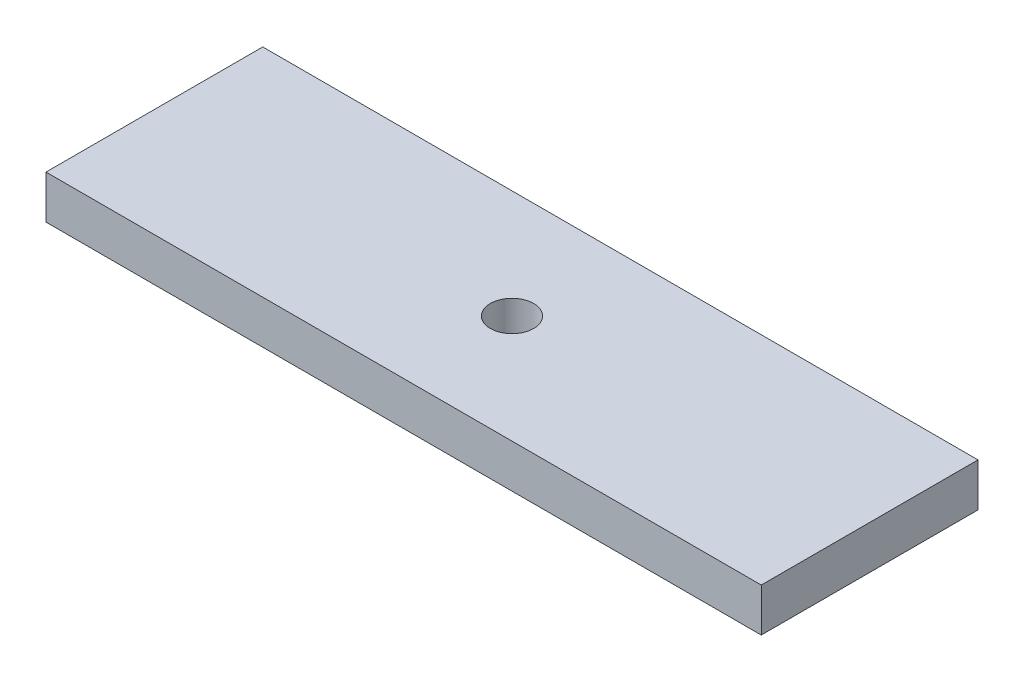
ISO-10303-21;
HEADER;
FILE_DESCRIPTION(('STEP AP214'),'2;1');
FILE_NAME('part.step','',(''),(''),'','','');
FILE_SCHEMA(('AUTOMOTIVE_DESIGN { 1 0 10303 214 1 1 1 1 }'));
ENDSEC;
DATA;
#1=APPLICATION_CONTEXT('core data for automotive mechanical design processes');
#2=APPLICATION_PROTOCOL_DEFINITION('international standard','automotive_design',2000,#1);
#3=PRODUCT_CONTEXT('',#1,'mechanical');
#4=PRODUCT('Part','Part','',(#3));
#5=PRODUCT_RELATED_PRODUCT_CATEGORY('part','',(#4));
#6=PRODUCT_DEFINITION_FORMATION('','',#4);
#7=PRODUCT_DEFINITION_CONTEXT('part definition',#1,'design');
#8=PRODUCT_DEFINITION('design','',#6,#7);
#9=PRODUCT_DEFINITION_SHAPE('','',#8);
#10=(LENGTH_UNIT() NAMED_UNIT(*) SI_UNIT(.MILLI.,.METRE.));
#11=(NAMED_UNIT(*) PLANE_ANGLE_UNIT() SI_UNIT($,.RADIAN.));
#12=(NAMED_UNIT(*) SI_UNIT($,.STERADIAN.) SOLID_ANGLE_UNIT());
#13=UNCERTAINTY_MEASURE_WITH_UNIT(LENGTH_MEASURE(1.E-05),#10,'distance_accuracy_value','');
#14=(GEOMETRIC_REPRESENTATION_CONTEXT(3) GLOBAL_UNCERTAINTY_ASSIGNED_CONTEXT((#13)) GLOBAL_UNIT_ASSIGNED_CONTEXT((#10,
#11,#12)) REPRESENTATION_CONTEXT('',''));
#15=CARTESIAN_POINT('',(0.,0.,0.));
#16=DIRECTION('',(0.,0.,1.));
#17=DIRECTION('',(1.,0.,0.));
#18=AXIS2_PLACEMENT_3D('',#15,#16,#17);
#19=CARTESIAN_POINT('',(0.,4.,0.));
#20=DIRECTION('',(1.,0.,0.));
#21=DIRECTION('',(0.,0.,-1.));
#22=AXIS2_PLACEMENT_3D('',#19,#20,#21);
#23=PLANE('',#22);
#24=DIRECTION('',(0.,0.,1.));
#25=VECTOR('',#24,1.);
#26=CARTESIAN_POINT('',(0.,0.,0.));
#27=LINE('',#26,#25);
#28=CARTESIAN_POINT('',(0.,0.,0.));
#29=VERTEX_POINT('',#28);
#30=CARTESIAN_POINT('',(0.,0.,20.));
#31=VERTEX_POINT('',#30);
#32=EDGE_CURVE('E96',#29,#31,#27,.T.);
#33=ORIENTED_EDGE('',*,*,#32,.T.);
#34=DIRECTION('',(0.,-1.,0.));
#35=VECTOR('',#34,1.);
#36=CARTESIAN_POINT('',(0.,4.,20.));
#37=LINE('',#36,#35);
#38=CARTESIAN_POINT('',(0.,4.,20.));
#39=VERTEX_POINT('',#38);
#40=EDGE_CURVE('E11',#39,#31,#37,.T.);
#41=ORIENTED_EDGE('',*,*,#40,.F.);
#42=DIRECTION('',(0.,0.,1.));
#43=VECTOR('',#42,1.);
#44=CARTESIAN_POINT('',(0.,4.,0.));
#45=LINE('',#44,#43);
#46=CARTESIAN_POINT('',(0.,4.,0.));
#47=VERTEX_POINT('',#46);
#48=EDGE_CURVE('E84',#47,#39,#45,.T.);
#49=ORIENTED_EDGE('',*,*,#48,.F.);
#50=DIRECTION('',(0.,-1.,0.));
#51=VECTOR('',#50,1.);
#52=CARTESIAN_POINT('',(0.,4.,0.));
#53=LINE('',#52,#51);
#54=EDGE_CURVE('E92',#47,#29,#53,.T.);
#55=ORIENTED_EDGE('',*,*,#54,.T.);
#56=EDGE_LOOP('',(#33,#41,#49,#55));
#57=FACE_BOUND('',#56,.T.);
#58=ADVANCED_FACE('F33',(#57),#23,.F.);
#59=CARTESIAN_POINT('',(0.,4.,20.));
#60=DIRECTION('',(0.,0.,-1.));
#61=DIRECTION('',(-1.,0.,0.));
#62=AXIS2_PLACEMENT_3D('',#59,#60,#61);
#63=PLANE('',#62);
#64=DIRECTION('',(1.,0.,0.));
#65=VECTOR('',#64,1.);
#66=CARTESIAN_POINT('',(0.,0.,20.));
#67=LINE('',#66,#65);
#68=CARTESIAN_POINT('',(66.,0.,20.));
#69=VERTEX_POINT('',#68);
#70=EDGE_CURVE('E88',#31,#69,#67,.T.);
#71=ORIENTED_EDGE('',*,*,#70,.T.);
#72=DIRECTION('',(0.,-1.,0.));
#73=VECTOR('',#72,1.);
#74=CARTESIAN_POINT('',(66.,4.,20.));
#75=LINE('',#74,#73);
#76=CARTESIAN_POINT('',(66.,4.,20.));
#77=VERTEX_POINT('',#76);
#78=EDGE_CURVE('E41',#77,#69,#75,.T.);
#79=ORIENTED_EDGE('',*,*,#78,.F.);
#80=DIRECTION('',(1.,0.,0.));
#81=VECTOR('',#80,1.);
#82=CARTESIAN_POINT('',(0.,4.,20.));
#83=LINE('',#82,#81);
#84=EDGE_CURVE('E79',#39,#77,#83,.T.);
#85=ORIENTED_EDGE('',*,*,#84,.F.);
#86=ORIENTED_EDGE('',*,*,#40,.T.);
#87=EDGE_LOOP('',(#71,#79,#85,#86));
#88=FACE_BOUND('',#87,.T.);
#89=ADVANCED_FACE('F87',(#88),#63,.F.);
#90=CARTESIAN_POINT('',(66.,4.,0.));
#91=DIRECTION('',(-1.,0.,0.));
#92=DIRECTION('',(0.,0.,1.));
#93=AXIS2_PLACEMENT_3D('',#90,#91,#92);
#94=PLANE('',#93);
#95=DIRECTION('',(0.,0.,-1.));
#96=VECTOR('',#95,1.);
#97=CARTESIAN_POINT('',(66.,0.,0.));
#98=LINE('',#97,#96);
#99=CARTESIAN_POINT('',(66.,0.,0.));
#100=VERTEX_POINT('',#99);
#101=EDGE_CURVE('E66',#69,#100,#98,.T.);
#102=ORIENTED_EDGE('',*,*,#101,.T.);
#103=DIRECTION('',(0.,-1.,0.));
#104=VECTOR('',#103,1.);
#105=CARTESIAN_POINT('',(66.,4.,0.));
#106=LINE('',#105,#104);
#107=CARTESIAN_POINT('',(66.,4.,0.));
#108=VERTEX_POINT('',#107);
#109=EDGE_CURVE('E89',#108,#100,#106,.T.);
#110=ORIENTED_EDGE('',*,*,#109,.F.);
#111=DIRECTION('',(0.,0.,-1.));
#112=VECTOR('',#111,1.);
#113=CARTESIAN_POINT('',(66.,4.,0.));
#114=LINE('',#113,#112);
#115=EDGE_CURVE('E82',#77,#108,#114,.T.);
#116=ORIENTED_EDGE('',*,*,#115,.F.);
#117=ORIENTED_EDGE('',*,*,#78,.T.);
#118=EDGE_LOOP('',(#102,#110,#116,#117));
#119=FACE_BOUND('',#118,.T.);
#120=ADVANCED_FACE('F90',(#119),#94,.F.);
#121=CARTESIAN_POINT('',(0.,4.,0.));
#122=DIRECTION('',(0.,0.,1.));
#123=DIRECTION('',(1.,0.,0.));
#124=AXIS2_PLACEMENT_3D('',#121,#122,#123);
#125=PLANE('',#124);
#126=DIRECTION('',(-1.,0.,0.));
#127=VECTOR('',#126,1.);
#128=CARTESIAN_POINT('',(0.,0.,0.));
#129=LINE('',#128,#127);
#130=EDGE_CURVE('E72',#100,#29,#129,.T.);
#131=ORIENTED_EDGE('',*,*,#130,.T.);
#132=ORIENTED_EDGE('',*,*,#54,.F.);
#133=DIRECTION('',(-1.,0.,0.));
#134=VECTOR('',#133,1.);
#135=CARTESIAN_POINT('',(0.,4.,0.));
#136=LINE('',#135,#134);
#137=EDGE_CURVE('E49',#108,#47,#136,.T.);
#138=ORIENTED_EDGE('',*,*,#137,.F.);
#139=ORIENTED_EDGE('',*,*,#109,.T.);
#140=EDGE_LOOP('',(#131,#132,#138,#139));
#141=FACE_BOUND('',#140,.T.);
#142=ADVANCED_FACE('F104',(#141),#125,.F.);
#143=CARTESIAN_POINT('',(0.,4.,0.));
#144=DIRECTION('',(0.,1.,0.));
#145=DIRECTION('',(0.,0.,1.));
#146=AXIS2_PLACEMENT_3D('',#143,#144,#145);
#147=PLANE('',#146);
#148=CARTESIAN_POINT('',(33.,4.,10.));
#149=DIRECTION('',(0.,1.,0.));
#150=DIRECTION('',(0.,0.,1.));
#151=AXIS2_PLACEMENT_3D('',#148,#149,#150);
#152=CIRCLE('',#151,2.);
#153=CARTESIAN_POINT('',(33.,4.,12.));
#154=VERTEX_POINT('',#153);
#155=EDGE_CURVE('E110',#154,#154,#152,.T.);
#156=ORIENTED_EDGE('',*,*,#155,.F.);
#157=EDGE_LOOP('',(#156));
#158=FACE_BOUND('',#157,.T.);
#159=ORIENTED_EDGE('',*,*,#48,.T.);
#160=ORIENTED_EDGE('',*,*,#84,.T.);
#161=ORIENTED_EDGE('',*,*,#115,.T.);
#162=ORIENTED_EDGE('',*,*,#137,.T.);
#163=EDGE_LOOP('',(#159,#160,#161,#162));
#164=FACE_BOUND('',#163,.T.);
#165=ADVANCED_FACE('F80',(#158,#164),#147,.T.);
#166=CARTESIAN_POINT('',(0.,0.,0.));
#167=DIRECTION('',(0.,1.,0.));
#168=DIRECTION('',(0.,0.,1.));
#169=AXIS2_PLACEMENT_3D('',#166,#167,#168);
#170=PLANE('',#169);
#171=CARTESIAN_POINT('',(33.,0.,10.));
#172=DIRECTION('',(0.,1.,0.));
#173=DIRECTION('',(0.,0.,1.));
#174=AXIS2_PLACEMENT_3D('',#171,#172,#173);
#175=CIRCLE('',#174,2.);
#176=CARTESIAN_POINT('',(33.,0.,12.));
#177=VERTEX_POINT('',#176);
#178=EDGE_CURVE('E99',#177,#177,#175,.T.);
#179=ORIENTED_EDGE('',*,*,#178,.T.);
#180=EDGE_LOOP('',(#179));
#181=FACE_BOUND('',#180,.T.);
#182=ORIENTED_EDGE('',*,*,#32,.F.);
#183=ORIENTED_EDGE('',*,*,#130,.F.);
#184=ORIENTED_EDGE('',*,*,#101,.F.);
#185=ORIENTED_EDGE('',*,*,#70,.F.);
#186=EDGE_LOOP('',(#182,#183,#184,#185));
#187=FACE_BOUND('',#186,.T.);
#188=ADVANCED_FACE('F107',(#181,#187),#170,.F.);
#189=CARTESIAN_POINT('',(33.,0.,10.));
#190=DIRECTION('',(0.,1.,0.));
#191=DIRECTION('',(0.,0.,1.));
#192=AXIS2_PLACEMENT_3D('',#189,#190,#191);
#193=CYLINDRICAL_SURFACE('',#192,2.);
#194=ORIENTED_EDGE('',*,*,#178,.F.);
#195=EDGE_LOOP('',(#194));
#196=FACE_BOUND('',#195,.T.);
#197=ORIENTED_EDGE('',*,*,#155,.T.);
#198=EDGE_LOOP('',(#197));
#199=FACE_BOUND('',#198,.T.);
#200=ADVANCED_FACE('F117',(#196,#199),#193,.F.);
#201=CLOSED_SHELL('',(#58,#89,#120,#142,#165,#188,#200));
#202=MANIFOLD_SOLID_BREP('B2',#201);
#203=ADVANCED_BREP_SHAPE_REPRESENTATION('',(#18,#202),#14);
#204=SHAPE_DEFINITION_REPRESENTATION(#9,#203);
ENDSEC;
END-ISO-10303-21;
